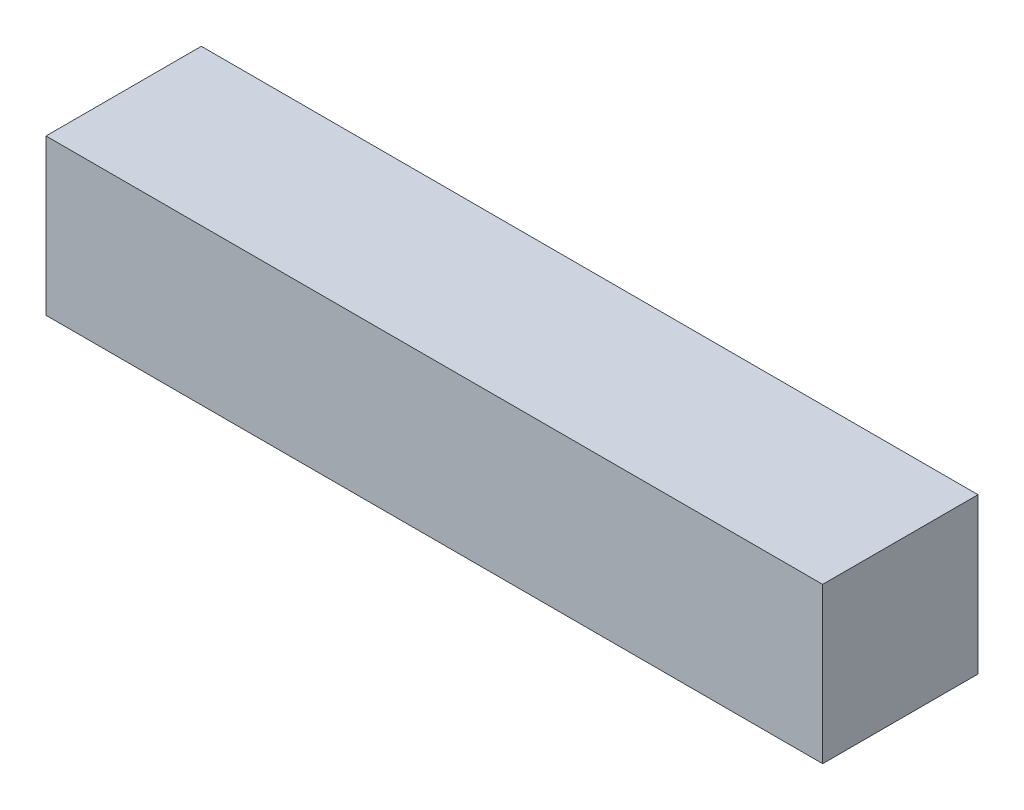
ISO-10303-21;
HEADER;
FILE_DESCRIPTION(('STEP AP214'),'2;1');
FILE_NAME('part.step','',(''),(''),'','','');
FILE_SCHEMA(('AUTOMOTIVE_DESIGN { 1 0 10303 214 1 1 1 1 }'));
ENDSEC;
DATA;
#1=APPLICATION_CONTEXT('core data for automotive mechanical design processes');
#2=APPLICATION_PROTOCOL_DEFINITION('international standard','automotive_design',2000,#1);
#3=PRODUCT_CONTEXT('',#1,'mechanical');
#4=PRODUCT('Part','Part','',(#3));
#5=PRODUCT_RELATED_PRODUCT_CATEGORY('part','',(#4));
#6=PRODUCT_DEFINITION_FORMATION('','',#4);
#7=PRODUCT_DEFINITION_CONTEXT('part definition',#1,'design');
#8=PRODUCT_DEFINITION('design','',#6,#7);
#9=PRODUCT_DEFINITION_SHAPE('','',#8);
#10=(LENGTH_UNIT() NAMED_UNIT(*) SI_UNIT(.MILLI.,.METRE.));
#11=(NAMED_UNIT(*) PLANE_ANGLE_UNIT() SI_UNIT($,.RADIAN.));
#12=(NAMED_UNIT(*) SI_UNIT($,.STERADIAN.) SOLID_ANGLE_UNIT());
#13=UNCERTAINTY_MEASURE_WITH_UNIT(LENGTH_MEASURE(1.E-05),#10,'distance_accuracy_value','');
#14=(GEOMETRIC_REPRESENTATION_CONTEXT(3) GLOBAL_UNCERTAINTY_ASSIGNED_CONTEXT((#13)) GLOBAL_UNIT_ASSIGNED_CONTEXT((#10,
#11,#12)) REPRESENTATION_CONTEXT('',''));
#15=CARTESIAN_POINT('',(0.,0.,0.));
#16=DIRECTION('',(0.,0.,1.));
#17=DIRECTION('',(1.,0.,0.));
#18=AXIS2_PLACEMENT_3D('',#15,#16,#17);
#19=CARTESIAN_POINT('',(0.,20.,20.));
#20=DIRECTION('',(1.,0.,0.));
#21=DIRECTION('',(0.,0.,-1.));
#22=AXIS2_PLACEMENT_3D('',#19,#20,#21);
#23=PLANE('',#22);
#24=DIRECTION('',(0.,-1.,0.));
#25=VECTOR('',#24,1.);
#26=CARTESIAN_POINT('',(0.,20.,0.));
#27=LINE('',#26,#25);
#28=CARTESIAN_POINT('',(0.,20.,0.));
#29=VERTEX_POINT('',#28);
#30=CARTESIAN_POINT('',(0.,0.,0.));
#31=VERTEX_POINT('',#30);
#32=EDGE_CURVE('E97',#29,#31,#27,.T.);
#33=ORIENTED_EDGE('',*,*,#32,.T.);
#34=DIRECTION('',(0.,0.,-1.));
#35=VECTOR('',#34,1.);
#36=CARTESIAN_POINT('',(0.,0.,20.));
#37=LINE('',#36,#35);
#38=CARTESIAN_POINT('',(0.,0.,20.));
#39=VERTEX_POINT('',#38);
#40=EDGE_CURVE('E11',#39,#31,#37,.T.);
#41=ORIENTED_EDGE('',*,*,#40,.F.);
#42=DIRECTION('',(0.,-1.,0.));
#43=VECTOR('',#42,1.);
#44=CARTESIAN_POINT('',(0.,20.,20.));
#45=LINE('',#44,#43);
#46=CARTESIAN_POINT('',(0.,20.,20.));
#47=VERTEX_POINT('',#46);
#48=EDGE_CURVE('E85',#47,#39,#45,.T.);
#49=ORIENTED_EDGE('',*,*,#48,.F.);
#50=DIRECTION('',(0.,0.,-1.));
#51=VECTOR('',#50,1.);
#52=CARTESIAN_POINT('',(0.,20.,20.));
#53=LINE('',#52,#51);
#54=EDGE_CURVE('E93',#47,#29,#53,.T.);
#55=ORIENTED_EDGE('',*,*,#54,.T.);
#56=EDGE_LOOP('',(#33,#41,#49,#55));
#57=FACE_BOUND('',#56,.T.);
#58=ADVANCED_FACE('F34',(#57),#23,.F.);
#59=CARTESIAN_POINT('',(0.,0.,20.));
#60=DIRECTION('',(0.,1.,0.));
#61=DIRECTION('',(0.,0.,1.));
#62=AXIS2_PLACEMENT_3D('',#59,#60,#61);
#63=PLANE('',#62);
#64=DIRECTION('',(1.,0.,0.));
#65=VECTOR('',#64,1.);
#66=CARTESIAN_POINT('',(0.,0.,0.));
#67=LINE('',#66,#65);
#68=CARTESIAN_POINT('',(100.,0.,0.));
#69=VERTEX_POINT('',#68);
#70=EDGE_CURVE('E89',#31,#69,#67,.T.);
#71=ORIENTED_EDGE('',*,*,#70,.T.);
#72=DIRECTION('',(0.,0.,-1.));
#73=VECTOR('',#72,1.);
#74=CARTESIAN_POINT('',(100.,0.,20.));
#75=LINE('',#74,#73);
#76=CARTESIAN_POINT('',(100.,0.,20.));
#77=VERTEX_POINT('',#76);
#78=EDGE_CURVE('E42',#77,#69,#75,.T.);
#79=ORIENTED_EDGE('',*,*,#78,.F.);
#80=DIRECTION('',(1.,0.,0.));
#81=VECTOR('',#80,1.);
#82=CARTESIAN_POINT('',(0.,0.,20.));
#83=LINE('',#82,#81);
#84=EDGE_CURVE('E80',#39,#77,#83,.T.);
#85=ORIENTED_EDGE('',*,*,#84,.F.);
#86=ORIENTED_EDGE('',*,*,#40,.T.);
#87=EDGE_LOOP('',(#71,#79,#85,#86));
#88=FACE_BOUND('',#87,.T.);
#89=ADVANCED_FACE('F88',(#88),#63,.F.);
#90=CARTESIAN_POINT('',(100.,0.,20.));
#91=DIRECTION('',(-1.,0.,0.));
#92=DIRECTION('',(0.,0.,1.));
#93=AXIS2_PLACEMENT_3D('',#90,#91,#92);
#94=PLANE('',#93);
#95=DIRECTION('',(0.,1.,0.));
#96=VECTOR('',#95,1.);
#97=CARTESIAN_POINT('',(100.,0.,0.));
#98=LINE('',#97,#96);
#99=CARTESIAN_POINT('',(100.,20.,0.));
#100=VERTEX_POINT('',#99);
#101=EDGE_CURVE('E67',#69,#100,#98,.T.);
#102=ORIENTED_EDGE('',*,*,#101,.T.);
#103=DIRECTION('',(0.,0.,-1.));
#104=VECTOR('',#103,1.);
#105=CARTESIAN_POINT('',(100.,20.,20.));
#106=LINE('',#105,#104);
#107=CARTESIAN_POINT('',(100.,20.,20.));
#108=VERTEX_POINT('',#107);
#109=EDGE_CURVE('E90',#108,#100,#106,.T.);
#110=ORIENTED_EDGE('',*,*,#109,.F.);
#111=DIRECTION('',(0.,1.,0.));
#112=VECTOR('',#111,1.);
#113=CARTESIAN_POINT('',(100.,0.,20.));
#114=LINE('',#113,#112);
#115=EDGE_CURVE('E83',#77,#108,#114,.T.);
#116=ORIENTED_EDGE('',*,*,#115,.F.);
#117=ORIENTED_EDGE('',*,*,#78,.T.);
#118=EDGE_LOOP('',(#102,#110,#116,#117));
#119=FACE_BOUND('',#118,.T.);
#120=ADVANCED_FACE('F91',(#119),#94,.F.);
#121=CARTESIAN_POINT('',(100.,20.,20.));
#122=DIRECTION('',(0.,-1.,0.));
#123=DIRECTION('',(0.,0.,-1.));
#124=AXIS2_PLACEMENT_3D('',#121,#122,#123);
#125=PLANE('',#124);
#126=DIRECTION('',(-1.,0.,0.));
#127=VECTOR('',#126,1.);
#128=CARTESIAN_POINT('',(100.,20.,0.));
#129=LINE('',#128,#127);
#130=EDGE_CURVE('E73',#100,#29,#129,.T.);
#131=ORIENTED_EDGE('',*,*,#130,.T.);
#132=ORIENTED_EDGE('',*,*,#54,.F.);
#133=DIRECTION('',(-1.,0.,0.));
#134=VECTOR('',#133,1.);
#135=CARTESIAN_POINT('',(100.,20.,20.));
#136=LINE('',#135,#134);
#137=EDGE_CURVE('E50',#108,#47,#136,.T.);
#138=ORIENTED_EDGE('',*,*,#137,.F.);
#139=ORIENTED_EDGE('',*,*,#109,.T.);
#140=EDGE_LOOP('',(#131,#132,#138,#139));
#141=FACE_BOUND('',#140,.T.);
#142=ADVANCED_FACE('F104',(#141),#125,.F.);
#143=CARTESIAN_POINT('',(0.,0.,20.));
#144=DIRECTION('',(0.,0.,1.));
#145=DIRECTION('',(1.,0.,0.));
#146=AXIS2_PLACEMENT_3D('',#143,#144,#145);
#147=PLANE('',#146);
#148=ORIENTED_EDGE('',*,*,#48,.T.);
#149=ORIENTED_EDGE('',*,*,#84,.T.);
#150=ORIENTED_EDGE('',*,*,#115,.T.);
#151=ORIENTED_EDGE('',*,*,#137,.T.);
#152=EDGE_LOOP('',(#148,#149,#150,#151));
#153=FACE_BOUND('',#152,.T.);
#154=ADVANCED_FACE('F81',(#153),#147,.T.);
#155=CARTESIAN_POINT('',(0.,0.,0.));
#156=DIRECTION('',(0.,0.,1.));
#157=DIRECTION('',(1.,0.,0.));
#158=AXIS2_PLACEMENT_3D('',#155,#156,#157);
#159=PLANE('',#158);
#160=ORIENTED_EDGE('',*,*,#32,.F.);
#161=ORIENTED_EDGE('',*,*,#130,.F.);
#162=ORIENTED_EDGE('',*,*,#101,.F.);
#163=ORIENTED_EDGE('',*,*,#70,.F.);
#164=EDGE_LOOP('',(#160,#161,#162,#163));
#165=FACE_BOUND('',#164,.T.);
#166=ADVANCED_FACE('F107',(#165),#159,.F.);
#167=CLOSED_SHELL('',(#58,#89,#120,#142,#154,#166));
#168=MANIFOLD_SOLID_BREP('B2',#167);
#169=ADVANCED_BREP_SHAPE_REPRESENTATION('',(#18,#168),#14);
#170=SHAPE_DEFINITION_REPRESENTATION(#9,#169);
ENDSEC;
END-ISO-10303-21;
